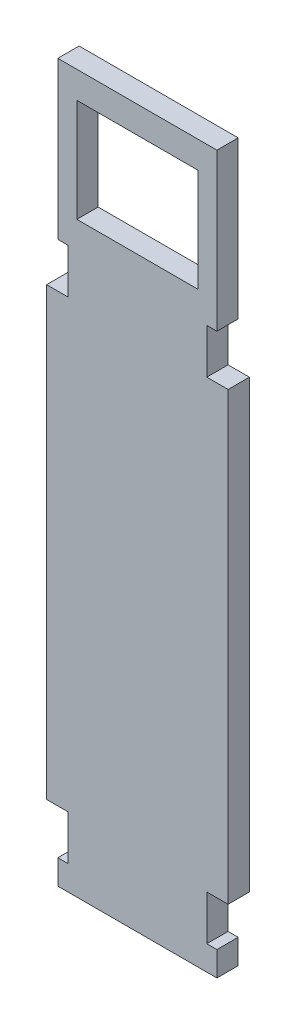
ISO-10303-21;
HEADER;
FILE_DESCRIPTION(('STEP AP214'),'2;1');
FILE_NAME('part.step','',(''),(''),'','','');
FILE_SCHEMA(('AUTOMOTIVE_DESIGN { 1 0 10303 214 1 1 1 1 }'));
ENDSEC;
DATA;
#1=APPLICATION_CONTEXT('core data for automotive mechanical design processes');
#2=APPLICATION_PROTOCOL_DEFINITION('international standard','automotive_design',2000,#1);
#3=PRODUCT_CONTEXT('',#1,'mechanical');
#4=PRODUCT('Part','Part','',(#3));
#5=PRODUCT_RELATED_PRODUCT_CATEGORY('part','',(#4));
#6=PRODUCT_DEFINITION_FORMATION('','',#4);
#7=PRODUCT_DEFINITION_CONTEXT('part definition',#1,'design');
#8=PRODUCT_DEFINITION('design','',#6,#7);
#9=PRODUCT_DEFINITION_SHAPE('','',#8);
#10=(LENGTH_UNIT() NAMED_UNIT(*) SI_UNIT(.MILLI.,.METRE.));
#11=(NAMED_UNIT(*) PLANE_ANGLE_UNIT() SI_UNIT($,.RADIAN.));
#12=(NAMED_UNIT(*) SI_UNIT($,.STERADIAN.) SOLID_ANGLE_UNIT());
#13=UNCERTAINTY_MEASURE_WITH_UNIT(LENGTH_MEASURE(1.E-05),#10,'distance_accuracy_value','');
#14=(GEOMETRIC_REPRESENTATION_CONTEXT(3) GLOBAL_UNCERTAINTY_ASSIGNED_CONTEXT((#13)) GLOBAL_UNIT_ASSIGNED_CONTEXT((#10,
#11,#12)) REPRESENTATION_CONTEXT('',''));
#15=CARTESIAN_POINT('',(0.,0.,0.));
#16=DIRECTION('',(0.,0.,1.));
#17=DIRECTION('',(1.,0.,0.));
#18=AXIS2_PLACEMENT_3D('',#15,#16,#17);
#19=CARTESIAN_POINT('',(0.,0.,4.75));
#20=DIRECTION('',(0.,0.,1.));
#21=DIRECTION('',(1.,0.,0.));
#22=AXIS2_PLACEMENT_3D('',#19,#20,#21);
#23=PLANE('',#22);
#24=DIRECTION('',(0.,1.,0.));
#25=VECTOR('',#24,1.);
#26=CARTESIAN_POINT('',(33.25,119.5,4.75));
#27=LINE('',#26,#25);
#28=CARTESIAN_POINT('',(33.25,119.5,4.75));
#29=VERTEX_POINT('',#28);
#30=CARTESIAN_POINT('',(33.25,154.5,4.75));
#31=VERTEX_POINT('',#30);
#32=EDGE_CURVE('E230',#29,#31,#27,.T.);
#33=ORIENTED_EDGE('',*,*,#32,.T.);
#34=DIRECTION('',(-1.,0.,0.));
#35=VECTOR('',#34,1.);
#36=CARTESIAN_POINT('',(33.25,154.5,4.75));
#37=LINE('',#36,#35);
#38=CARTESIAN_POINT('',(-2.25000000000001,154.5,4.75));
#39=VERTEX_POINT('',#38);
#40=EDGE_CURVE('E233',#31,#39,#37,.T.);
#41=ORIENTED_EDGE('',*,*,#40,.T.);
#42=DIRECTION('',(0.,-1.,0.));
#43=VECTOR('',#42,1.);
#44=CARTESIAN_POINT('',(-2.24999999999997,119.5,4.75));
#45=LINE('',#44,#43);
#46=CARTESIAN_POINT('',(-2.24999999999997,119.5,4.75));
#47=VERTEX_POINT('',#46);
#48=EDGE_CURVE('E236',#39,#47,#45,.T.);
#49=ORIENTED_EDGE('',*,*,#48,.T.);
#50=DIRECTION('',(1.,0.,0.));
#51=VECTOR('',#50,1.);
#52=CARTESIAN_POINT('',(0.,119.5,4.75));
#53=LINE('',#52,#51);
#54=CARTESIAN_POINT('',(0.,119.5,4.75));
#55=VERTEX_POINT('',#54);
#56=EDGE_CURVE('E238',#47,#55,#53,.T.);
#57=ORIENTED_EDGE('',*,*,#56,.T.);
#58=DIRECTION('',(0.,-1.,0.));
#59=VECTOR('',#58,1.);
#60=CARTESIAN_POINT('',(0.,119.5,4.75));
#61=LINE('',#60,#59);
#62=CARTESIAN_POINT('',(0.,109.5,4.75));
#63=VERTEX_POINT('',#62);
#64=EDGE_CURVE('E240',#55,#63,#61,.T.);
#65=ORIENTED_EDGE('',*,*,#64,.T.);
#66=DIRECTION('',(-1.,0.,0.));
#67=VECTOR('',#66,1.);
#68=CARTESIAN_POINT('',(-4.75,109.5,4.75));
#69=LINE('',#68,#67);
#70=CARTESIAN_POINT('',(-4.75,109.5,4.75));
#71=VERTEX_POINT('',#70);
#72=EDGE_CURVE('E242',#63,#71,#69,.T.);
#73=ORIENTED_EDGE('',*,*,#72,.T.);
#74=DIRECTION('',(0.,-1.,0.));
#75=VECTOR('',#74,1.);
#76=CARTESIAN_POINT('',(-4.75,9.99999999999999,4.75));
#77=LINE('',#76,#75);
#78=CARTESIAN_POINT('',(-4.75,9.99999999999999,4.75));
#79=VERTEX_POINT('',#78);
#80=EDGE_CURVE('E244',#71,#79,#77,.T.);
#81=ORIENTED_EDGE('',*,*,#80,.T.);
#82=DIRECTION('',(1.,0.,0.));
#83=VECTOR('',#82,1.);
#84=CARTESIAN_POINT('',(-4.75,9.99999999999999,4.75));
#85=LINE('',#84,#83);
#86=CARTESIAN_POINT('',(0.,9.99999999999999,4.75));
#87=VERTEX_POINT('',#86);
#88=EDGE_CURVE('E246',#79,#87,#85,.T.);
#89=ORIENTED_EDGE('',*,*,#88,.T.);
#90=DIRECTION('',(0.,-1.,0.));
#91=VECTOR('',#90,1.);
#92=CARTESIAN_POINT('',(0.,0.,4.75));
#93=LINE('',#92,#91);
#94=CARTESIAN_POINT('',(0.,0.,4.75));
#95=VERTEX_POINT('',#94);
#96=EDGE_CURVE('E248',#87,#95,#93,.T.);
#97=ORIENTED_EDGE('',*,*,#96,.T.);
#98=DIRECTION('',(-1.,0.,0.));
#99=VECTOR('',#98,1.);
#100=CARTESIAN_POINT('',(0.,0.,4.75));
#101=LINE('',#100,#99);
#102=CARTESIAN_POINT('',(-2.24999999999999,0.,4.75));
#103=VERTEX_POINT('',#102);
#104=EDGE_CURVE('E250',#95,#103,#101,.T.);
#105=ORIENTED_EDGE('',*,*,#104,.T.);
#106=DIRECTION('',(0.,-1.,0.));
#107=VECTOR('',#106,1.);
#108=CARTESIAN_POINT('',(-2.24999999999999,0.,4.75));
#109=LINE('',#108,#107);
#110=CARTESIAN_POINT('',(-2.24999999999999,-5.49999999999998,4.75));
#111=VERTEX_POINT('',#110);
#112=EDGE_CURVE('E252',#103,#111,#109,.T.);
#113=ORIENTED_EDGE('',*,*,#112,.T.);
#114=DIRECTION('',(1.,0.,0.));
#115=VECTOR('',#114,1.);
#116=CARTESIAN_POINT('',(33.25,-5.49999999999998,4.75));
#117=LINE('',#116,#115);
#118=CARTESIAN_POINT('',(33.25,-5.49999999999998,4.75));
#119=VERTEX_POINT('',#118);
#120=EDGE_CURVE('E254',#111,#119,#117,.T.);
#121=ORIENTED_EDGE('',*,*,#120,.T.);
#122=DIRECTION('',(0.,1.,0.));
#123=VECTOR('',#122,1.);
#124=CARTESIAN_POINT('',(33.25,0.,4.75));
#125=LINE('',#124,#123);
#126=CARTESIAN_POINT('',(33.25,0.,4.75));
#127=VERTEX_POINT('',#126);
#128=EDGE_CURVE('E256',#119,#127,#125,.T.);
#129=ORIENTED_EDGE('',*,*,#128,.T.);
#130=DIRECTION('',(-1.,0.,0.));
#131=VECTOR('',#130,1.);
#132=CARTESIAN_POINT('',(33.25,0.,4.75));
#133=LINE('',#132,#131);
#134=CARTESIAN_POINT('',(31.,0.,4.75));
#135=VERTEX_POINT('',#134);
#136=EDGE_CURVE('E258',#127,#135,#133,.T.);
#137=ORIENTED_EDGE('',*,*,#136,.T.);
#138=DIRECTION('',(0.,1.,0.));
#139=VECTOR('',#138,1.);
#140=CARTESIAN_POINT('',(31.,0.,4.75));
#141=LINE('',#140,#139);
#142=CARTESIAN_POINT('',(31.,9.99999999999999,4.75));
#143=VERTEX_POINT('',#142);
#144=EDGE_CURVE('E260',#135,#143,#141,.T.);
#145=ORIENTED_EDGE('',*,*,#144,.T.);
#146=DIRECTION('',(1.,0.,0.));
#147=VECTOR('',#146,1.);
#148=CARTESIAN_POINT('',(35.75,9.99999999999999,4.75));
#149=LINE('',#148,#147);
#150=CARTESIAN_POINT('',(35.75,9.99999999999999,4.75));
#151=VERTEX_POINT('',#150);
#152=EDGE_CURVE('E262',#143,#151,#149,.T.);
#153=ORIENTED_EDGE('',*,*,#152,.T.);
#154=DIRECTION('',(0.,1.,0.));
#155=VECTOR('',#154,1.);
#156=CARTESIAN_POINT('',(35.75,9.99999999999999,4.75));
#157=LINE('',#156,#155);
#158=CARTESIAN_POINT('',(35.75,109.5,4.75));
#159=VERTEX_POINT('',#158);
#160=EDGE_CURVE('E264',#151,#159,#157,.T.);
#161=ORIENTED_EDGE('',*,*,#160,.T.);
#162=DIRECTION('',(-1.,0.,0.));
#163=VECTOR('',#162,1.);
#164=CARTESIAN_POINT('',(35.75,109.5,4.75));
#165=LINE('',#164,#163);
#166=CARTESIAN_POINT('',(31.,109.5,4.75));
#167=VERTEX_POINT('',#166);
#168=EDGE_CURVE('E266',#159,#167,#165,.T.);
#169=ORIENTED_EDGE('',*,*,#168,.T.);
#170=DIRECTION('',(0.,1.,0.));
#171=VECTOR('',#170,1.);
#172=CARTESIAN_POINT('',(31.,119.5,4.75));
#173=LINE('',#172,#171);
#174=CARTESIAN_POINT('',(31.,119.5,4.75));
#175=VERTEX_POINT('',#174);
#176=EDGE_CURVE('E268',#167,#175,#173,.T.);
#177=ORIENTED_EDGE('',*,*,#176,.T.);
#178=DIRECTION('',(1.,0.,0.));
#179=VECTOR('',#178,1.);
#180=CARTESIAN_POINT('',(33.25,119.5,4.75));
#181=LINE('',#180,#179);
#182=EDGE_CURVE('E270',#175,#29,#181,.T.);
#183=ORIENTED_EDGE('',*,*,#182,.T.);
#184=EDGE_LOOP('',(#33,#41,#49,#57,#65,#73,#81,#89,#97,#105,#113,#121,#129,#137,#145,#153,#161,
#169,#177,#183));
#185=FACE_BOUND('',#184,.T.);
#186=DIRECTION('',(-1.,0.,0.));
#187=VECTOR('',#186,1.);
#188=CARTESIAN_POINT('',(2.,148.5,4.75));
#189=LINE('',#188,#187);
#190=CARTESIAN_POINT('',(29.,148.5,4.75));
#191=VERTEX_POINT('',#190);
#192=CARTESIAN_POINT('',(2.,148.5,4.75));
#193=VERTEX_POINT('',#192);
#194=EDGE_CURVE('E202',#191,#193,#189,.T.);
#195=ORIENTED_EDGE('',*,*,#194,.F.);
#196=DIRECTION('',(0.,1.,0.));
#197=VECTOR('',#196,1.);
#198=CARTESIAN_POINT('',(29.,125.5,4.75));
#199=LINE('',#198,#197);
#200=CARTESIAN_POINT('',(29.,125.5,4.75));
#201=VERTEX_POINT('',#200);
#202=EDGE_CURVE('E194',#201,#191,#199,.T.);
#203=ORIENTED_EDGE('',*,*,#202,.F.);
#204=DIRECTION('',(1.,0.,0.));
#205=VECTOR('',#204,1.);
#206=CARTESIAN_POINT('',(2.,125.5,4.75));
#207=LINE('',#206,#205);
#208=CARTESIAN_POINT('',(2.,125.5,4.75));
#209=VERTEX_POINT('',#208);
#210=EDGE_CURVE('E216',#209,#201,#207,.T.);
#211=ORIENTED_EDGE('',*,*,#210,.F.);
#212=DIRECTION('',(0.,-1.,0.));
#213=VECTOR('',#212,1.);
#214=CARTESIAN_POINT('',(2.,125.5,4.75));
#215=LINE('',#214,#213);
#216=EDGE_CURVE('E214',#193,#209,#215,.T.);
#217=ORIENTED_EDGE('',*,*,#216,.F.);
#218=EDGE_LOOP('',(#195,#203,#211,#217));
#219=FACE_BOUND('',#218,.T.);
#220=ADVANCED_FACE('F33',(#185,#219),#23,.T.);
#221=CARTESIAN_POINT('',(0.,0.,0.));
#222=DIRECTION('',(0.,0.,1.));
#223=DIRECTION('',(1.,0.,0.));
#224=AXIS2_PLACEMENT_3D('',#221,#222,#223);
#225=PLANE('',#224);
#226=DIRECTION('',(0.,1.,0.));
#227=VECTOR('',#226,1.);
#228=CARTESIAN_POINT('',(33.25,119.5,0.));
#229=LINE('',#228,#227);
#230=CARTESIAN_POINT('',(33.25,119.5,0.));
#231=VERTEX_POINT('',#230);
#232=CARTESIAN_POINT('',(33.25,154.5,0.));
#233=VERTEX_POINT('',#232);
#234=EDGE_CURVE('E210',#231,#233,#229,.T.);
#235=ORIENTED_EDGE('',*,*,#234,.F.);
#236=DIRECTION('',(1.,0.,0.));
#237=VECTOR('',#236,1.);
#238=CARTESIAN_POINT('',(33.25,119.5,0.));
#239=LINE('',#238,#237);
#240=CARTESIAN_POINT('',(31.,119.5,0.));
#241=VERTEX_POINT('',#240);
#242=EDGE_CURVE('E234',#241,#231,#239,.T.);
#243=ORIENTED_EDGE('',*,*,#242,.F.);
#244=DIRECTION('',(0.,1.,0.));
#245=VECTOR('',#244,1.);
#246=CARTESIAN_POINT('',(31.,119.5,0.));
#247=LINE('',#246,#245);
#248=CARTESIAN_POINT('',(31.,109.5,0.));
#249=VERTEX_POINT('',#248);
#250=EDGE_CURVE('E309',#249,#241,#247,.T.);
#251=ORIENTED_EDGE('',*,*,#250,.F.);
#252=DIRECTION('',(-1.,0.,0.));
#253=VECTOR('',#252,1.);
#254=CARTESIAN_POINT('',(35.75,109.5,0.));
#255=LINE('',#254,#253);
#256=CARTESIAN_POINT('',(35.75,109.5,0.));
#257=VERTEX_POINT('',#256);
#258=EDGE_CURVE('E307',#257,#249,#255,.T.);
#259=ORIENTED_EDGE('',*,*,#258,.F.);
#260=DIRECTION('',(0.,1.,0.));
#261=VECTOR('',#260,1.);
#262=CARTESIAN_POINT('',(35.75,9.99999999999999,0.));
#263=LINE('',#262,#261);
#264=CARTESIAN_POINT('',(35.75,9.99999999999999,0.));
#265=VERTEX_POINT('',#264);
#266=EDGE_CURVE('E305',#265,#257,#263,.T.);
#267=ORIENTED_EDGE('',*,*,#266,.F.);
#268=DIRECTION('',(1.,0.,0.));
#269=VECTOR('',#268,1.);
#270=CARTESIAN_POINT('',(35.75,9.99999999999999,0.));
#271=LINE('',#270,#269);
#272=CARTESIAN_POINT('',(31.,9.99999999999999,0.));
#273=VERTEX_POINT('',#272);
#274=EDGE_CURVE('E303',#273,#265,#271,.T.);
#275=ORIENTED_EDGE('',*,*,#274,.F.);
#276=DIRECTION('',(0.,1.,0.));
#277=VECTOR('',#276,1.);
#278=CARTESIAN_POINT('',(31.,0.,0.));
#279=LINE('',#278,#277);
#280=CARTESIAN_POINT('',(31.,0.,0.));
#281=VERTEX_POINT('',#280);
#282=EDGE_CURVE('E301',#281,#273,#279,.T.);
#283=ORIENTED_EDGE('',*,*,#282,.F.);
#284=DIRECTION('',(-1.,0.,0.));
#285=VECTOR('',#284,1.);
#286=CARTESIAN_POINT('',(33.25,0.,0.));
#287=LINE('',#286,#285);
#288=CARTESIAN_POINT('',(33.25,0.,0.));
#289=VERTEX_POINT('',#288);
#290=EDGE_CURVE('E299',#289,#281,#287,.T.);
#291=ORIENTED_EDGE('',*,*,#290,.F.);
#292=DIRECTION('',(0.,1.,0.));
#293=VECTOR('',#292,1.);
#294=CARTESIAN_POINT('',(33.25,0.,0.));
#295=LINE('',#294,#293);
#296=CARTESIAN_POINT('',(33.25,-5.49999999999998,0.));
#297=VERTEX_POINT('',#296);
#298=EDGE_CURVE('E297',#297,#289,#295,.T.);
#299=ORIENTED_EDGE('',*,*,#298,.F.);
#300=DIRECTION('',(1.,0.,0.));
#301=VECTOR('',#300,1.);
#302=CARTESIAN_POINT('',(33.25,-5.49999999999998,0.));
#303=LINE('',#302,#301);
#304=CARTESIAN_POINT('',(-2.24999999999999,-5.49999999999998,0.));
#305=VERTEX_POINT('',#304);
#306=EDGE_CURVE('E295',#305,#297,#303,.T.);
#307=ORIENTED_EDGE('',*,*,#306,.F.);
#308=DIRECTION('',(0.,-1.,0.));
#309=VECTOR('',#308,1.);
#310=CARTESIAN_POINT('',(-2.24999999999999,0.,0.));
#311=LINE('',#310,#309);
#312=CARTESIAN_POINT('',(-2.24999999999999,0.,0.));
#313=VERTEX_POINT('',#312);
#314=EDGE_CURVE('E293',#313,#305,#311,.T.);
#315=ORIENTED_EDGE('',*,*,#314,.F.);
#316=DIRECTION('',(-1.,0.,0.));
#317=VECTOR('',#316,1.);
#318=CARTESIAN_POINT('',(0.,0.,0.));
#319=LINE('',#318,#317);
#320=CARTESIAN_POINT('',(0.,0.,0.));
#321=VERTEX_POINT('',#320);
#322=EDGE_CURVE('E291',#321,#313,#319,.T.);
#323=ORIENTED_EDGE('',*,*,#322,.F.);
#324=DIRECTION('',(0.,-1.,0.));
#325=VECTOR('',#324,1.);
#326=CARTESIAN_POINT('',(0.,0.,0.));
#327=LINE('',#326,#325);
#328=CARTESIAN_POINT('',(0.,9.99999999999999,0.));
#329=VERTEX_POINT('',#328);
#330=EDGE_CURVE('E289',#329,#321,#327,.T.);
#331=ORIENTED_EDGE('',*,*,#330,.F.);
#332=DIRECTION('',(1.,0.,0.));
#333=VECTOR('',#332,1.);
#334=CARTESIAN_POINT('',(-4.75,9.99999999999999,0.));
#335=LINE('',#334,#333);
#336=CARTESIAN_POINT('',(-4.75,9.99999999999999,0.));
#337=VERTEX_POINT('',#336);
#338=EDGE_CURVE('E287',#337,#329,#335,.T.);
#339=ORIENTED_EDGE('',*,*,#338,.F.);
#340=DIRECTION('',(0.,-1.,0.));
#341=VECTOR('',#340,1.);
#342=CARTESIAN_POINT('',(-4.75,9.99999999999999,0.));
#343=LINE('',#342,#341);
#344=CARTESIAN_POINT('',(-4.75,109.5,0.));
#345=VERTEX_POINT('',#344);
#346=EDGE_CURVE('E285',#345,#337,#343,.T.);
#347=ORIENTED_EDGE('',*,*,#346,.F.);
#348=DIRECTION('',(-1.,0.,0.));
#349=VECTOR('',#348,1.);
#350=CARTESIAN_POINT('',(-4.75,109.5,0.));
#351=LINE('',#350,#349);
#352=CARTESIAN_POINT('',(0.,109.5,0.));
#353=VERTEX_POINT('',#352);
#354=EDGE_CURVE('E283',#353,#345,#351,.T.);
#355=ORIENTED_EDGE('',*,*,#354,.F.);
#356=DIRECTION('',(0.,-1.,0.));
#357=VECTOR('',#356,1.);
#358=CARTESIAN_POINT('',(0.,119.5,0.));
#359=LINE('',#358,#357);
#360=CARTESIAN_POINT('',(0.,119.5,0.));
#361=VERTEX_POINT('',#360);
#362=EDGE_CURVE('E281',#361,#353,#359,.T.);
#363=ORIENTED_EDGE('',*,*,#362,.F.);
#364=DIRECTION('',(1.,0.,0.));
#365=VECTOR('',#364,1.);
#366=CARTESIAN_POINT('',(0.,119.5,0.));
#367=LINE('',#366,#365);
#368=CARTESIAN_POINT('',(-2.24999999999997,119.5,0.));
#369=VERTEX_POINT('',#368);
#370=EDGE_CURVE('E279',#369,#361,#367,.T.);
#371=ORIENTED_EDGE('',*,*,#370,.F.);
#372=DIRECTION('',(0.,-1.,0.));
#373=VECTOR('',#372,1.);
#374=CARTESIAN_POINT('',(-2.24999999999997,119.5,0.));
#375=LINE('',#374,#373);
#376=CARTESIAN_POINT('',(-2.25000000000001,154.5,0.));
#377=VERTEX_POINT('',#376);
#378=EDGE_CURVE('E277',#377,#369,#375,.T.);
#379=ORIENTED_EDGE('',*,*,#378,.F.);
#380=DIRECTION('',(-1.,0.,0.));
#381=VECTOR('',#380,1.);
#382=CARTESIAN_POINT('',(33.25,154.5,0.));
#383=LINE('',#382,#381);
#384=EDGE_CURVE('E275',#233,#377,#383,.T.);
#385=ORIENTED_EDGE('',*,*,#384,.F.);
#386=EDGE_LOOP('',(#235,#243,#251,#259,#267,#275,#283,#291,#299,#307,#315,#323,#331,#339,#347,
#355,#363,#371,#379,#385));
#387=FACE_BOUND('',#386,.T.);
#388=DIRECTION('',(0.,1.,0.));
#389=VECTOR('',#388,1.);
#390=CARTESIAN_POINT('',(29.,125.5,0.));
#391=LINE('',#390,#389);
#392=CARTESIAN_POINT('',(29.,125.5,0.));
#393=VERTEX_POINT('',#392);
#394=CARTESIAN_POINT('',(29.,148.5,0.));
#395=VERTEX_POINT('',#394);
#396=EDGE_CURVE('E56',#393,#395,#391,.T.);
#397=ORIENTED_EDGE('',*,*,#396,.T.);
#398=DIRECTION('',(-1.,0.,0.));
#399=VECTOR('',#398,1.);
#400=CARTESIAN_POINT('',(2.,148.5,0.));
#401=LINE('',#400,#399);
#402=CARTESIAN_POINT('',(2.,148.5,0.));
#403=VERTEX_POINT('',#402);
#404=EDGE_CURVE('E209',#395,#403,#401,.T.);
#405=ORIENTED_EDGE('',*,*,#404,.T.);
#406=DIRECTION('',(0.,-1.,0.));
#407=VECTOR('',#406,1.);
#408=CARTESIAN_POINT('',(2.,125.5,0.));
#409=LINE('',#408,#407);
#410=CARTESIAN_POINT('',(2.,125.5,0.));
#411=VERTEX_POINT('',#410);
#412=EDGE_CURVE('E222',#403,#411,#409,.T.);
#413=ORIENTED_EDGE('',*,*,#412,.T.);
#414=DIRECTION('',(1.,0.,0.));
#415=VECTOR('',#414,1.);
#416=CARTESIAN_POINT('',(2.,125.5,0.));
#417=LINE('',#416,#415);
#418=EDGE_CURVE('E203',#411,#393,#417,.T.);
#419=ORIENTED_EDGE('',*,*,#418,.T.);
#420=EDGE_LOOP('',(#397,#405,#413,#419));
#421=FACE_BOUND('',#420,.T.);
#422=ADVANCED_FACE('F375',(#387,#421),#225,.F.);
#423=CARTESIAN_POINT('',(33.25,119.5,4.75));
#424=DIRECTION('',(-1.,0.,0.));
#425=DIRECTION('',(0.,-1.,0.));
#426=AXIS2_PLACEMENT_3D('',#423,#424,#425);
#427=PLANE('',#426);
#428=ORIENTED_EDGE('',*,*,#234,.T.);
#429=DIRECTION('',(0.,0.,-1.));
#430=VECTOR('',#429,1.);
#431=CARTESIAN_POINT('',(33.25,154.5,4.75));
#432=LINE('',#431,#430);
#433=EDGE_CURVE('E11',#31,#233,#432,.T.);
#434=ORIENTED_EDGE('',*,*,#433,.F.);
#435=ORIENTED_EDGE('',*,*,#32,.F.);
#436=DIRECTION('',(0.,0.,-1.));
#437=VECTOR('',#436,1.);
#438=CARTESIAN_POINT('',(33.25,119.5,4.75));
#439=LINE('',#438,#437);
#440=EDGE_CURVE('E272',#29,#231,#439,.T.);
#441=ORIENTED_EDGE('',*,*,#440,.T.);
#442=EDGE_LOOP('',(#428,#434,#435,#441));
#443=FACE_BOUND('',#442,.T.);
#444=ADVANCED_FACE('F35',(#443),#427,.F.);
#445=CARTESIAN_POINT('',(33.25,154.5,4.75));
#446=DIRECTION('',(0.,-1.,0.));
#447=DIRECTION('',(0.,0.,-1.));
#448=AXIS2_PLACEMENT_3D('',#445,#446,#447);
#449=PLANE('',#448);
#450=ORIENTED_EDGE('',*,*,#384,.T.);
#451=DIRECTION('',(0.,0.,-1.));
#452=VECTOR('',#451,1.);
#453=CARTESIAN_POINT('',(-2.25000000000001,154.5,4.75));
#454=LINE('',#453,#452);
#455=EDGE_CURVE('E41',#39,#377,#454,.T.);
#456=ORIENTED_EDGE('',*,*,#455,.F.);
#457=ORIENTED_EDGE('',*,*,#40,.F.);
#458=ORIENTED_EDGE('',*,*,#433,.T.);
#459=EDGE_LOOP('',(#450,#456,#457,#458));
#460=FACE_BOUND('',#459,.T.);
#461=ADVANCED_FACE('F392',(#460),#449,.F.);
#462=CARTESIAN_POINT('',(-2.24999999999997,119.5,4.75));
#463=DIRECTION('',(1.,0.,0.));
#464=DIRECTION('',(0.,1.,0.));
#465=AXIS2_PLACEMENT_3D('',#462,#463,#464);
#466=PLANE('',#465);
#467=ORIENTED_EDGE('',*,*,#378,.T.);
#468=DIRECTION('',(0.,0.,-1.));
#469=VECTOR('',#468,1.);
#470=CARTESIAN_POINT('',(-2.24999999999997,119.5,4.75));
#471=LINE('',#470,#469);
#472=EDGE_CURVE('E362',#47,#369,#471,.T.);
#473=ORIENTED_EDGE('',*,*,#472,.F.);
#474=ORIENTED_EDGE('',*,*,#48,.F.);
#475=ORIENTED_EDGE('',*,*,#455,.T.);
#476=EDGE_LOOP('',(#467,#473,#474,#475));
#477=FACE_BOUND('',#476,.T.);
#478=ADVANCED_FACE('F369',(#477),#466,.F.);
#479=CARTESIAN_POINT('',(0.,119.5,4.75));
#480=DIRECTION('',(0.,1.,0.));
#481=DIRECTION('',(0.,0.,1.));
#482=AXIS2_PLACEMENT_3D('',#479,#480,#481);
#483=PLANE('',#482);
#484=ORIENTED_EDGE('',*,*,#370,.T.);
#485=DIRECTION('',(0.,0.,-1.));
#486=VECTOR('',#485,1.);
#487=CARTESIAN_POINT('',(0.,119.5,4.75));
#488=LINE('',#487,#486);
#489=EDGE_CURVE('E359',#55,#361,#488,.T.);
#490=ORIENTED_EDGE('',*,*,#489,.F.);
#491=ORIENTED_EDGE('',*,*,#56,.F.);
#492=ORIENTED_EDGE('',*,*,#472,.T.);
#493=EDGE_LOOP('',(#484,#490,#491,#492));
#494=FACE_BOUND('',#493,.T.);
#495=ADVANCED_FACE('F381',(#494),#483,.F.);
#496=CARTESIAN_POINT('',(0.,119.5,4.75));
#497=DIRECTION('',(1.,0.,0.));
#498=DIRECTION('',(0.,1.,0.));
#499=AXIS2_PLACEMENT_3D('',#496,#497,#498);
#500=PLANE('',#499);
#501=ORIENTED_EDGE('',*,*,#362,.T.);
#502=DIRECTION('',(0.,0.,-1.));
#503=VECTOR('',#502,1.);
#504=CARTESIAN_POINT('',(0.,109.5,4.75));
#505=LINE('',#504,#503);
#506=EDGE_CURVE('E356',#63,#353,#505,.T.);
#507=ORIENTED_EDGE('',*,*,#506,.F.);
#508=ORIENTED_EDGE('',*,*,#64,.F.);
#509=ORIENTED_EDGE('',*,*,#489,.T.);
#510=EDGE_LOOP('',(#501,#507,#508,#509));
#511=FACE_BOUND('',#510,.T.);
#512=ADVANCED_FACE('F385',(#511),#500,.F.);
#513=CARTESIAN_POINT('',(-4.75,109.5,4.75));
#514=DIRECTION('',(0.,-1.,0.));
#515=DIRECTION('',(0.,0.,-1.));
#516=AXIS2_PLACEMENT_3D('',#513,#514,#515);
#517=PLANE('',#516);
#518=ORIENTED_EDGE('',*,*,#354,.T.);
#519=DIRECTION('',(0.,0.,-1.));
#520=VECTOR('',#519,1.);
#521=CARTESIAN_POINT('',(-4.75,109.5,4.75));
#522=LINE('',#521,#520);
#523=EDGE_CURVE('E353',#71,#345,#522,.T.);
#524=ORIENTED_EDGE('',*,*,#523,.F.);
#525=ORIENTED_EDGE('',*,*,#72,.F.);
#526=ORIENTED_EDGE('',*,*,#506,.T.);
#527=EDGE_LOOP('',(#518,#524,#525,#526));
#528=FACE_BOUND('',#527,.T.);
#529=ADVANCED_FACE('F465',(#528),#517,.F.);
#530=CARTESIAN_POINT('',(-4.75,9.99999999999999,4.75));
#531=DIRECTION('',(1.,0.,0.));
#532=DIRECTION('',(0.,1.,0.));
#533=AXIS2_PLACEMENT_3D('',#530,#531,#532);
#534=PLANE('',#533);
#535=ORIENTED_EDGE('',*,*,#346,.T.);
#536=DIRECTION('',(0.,0.,-1.));
#537=VECTOR('',#536,1.);
#538=CARTESIAN_POINT('',(-4.75,9.99999999999999,4.75));
#539=LINE('',#538,#537);
#540=EDGE_CURVE('E350',#79,#337,#539,.T.);
#541=ORIENTED_EDGE('',*,*,#540,.F.);
#542=ORIENTED_EDGE('',*,*,#80,.F.);
#543=ORIENTED_EDGE('',*,*,#523,.T.);
#544=EDGE_LOOP('',(#535,#541,#542,#543));
#545=FACE_BOUND('',#544,.T.);
#546=ADVANCED_FACE('F463',(#545),#534,.F.);
#547=CARTESIAN_POINT('',(-4.75,9.99999999999999,4.75));
#548=DIRECTION('',(0.,1.,0.));
#549=DIRECTION('',(-1.,0.,0.));
#550=AXIS2_PLACEMENT_3D('',#547,#548,#549);
#551=PLANE('',#550);
#552=ORIENTED_EDGE('',*,*,#338,.T.);
#553=DIRECTION('',(0.,0.,-1.));
#554=VECTOR('',#553,1.);
#555=CARTESIAN_POINT('',(0.,9.99999999999999,4.75));
#556=LINE('',#555,#554);
#557=EDGE_CURVE('E347',#87,#329,#556,.T.);
#558=ORIENTED_EDGE('',*,*,#557,.F.);
#559=ORIENTED_EDGE('',*,*,#88,.F.);
#560=ORIENTED_EDGE('',*,*,#540,.T.);
#561=EDGE_LOOP('',(#552,#558,#559,#560));
#562=FACE_BOUND('',#561,.T.);
#563=ADVANCED_FACE('F458',(#562),#551,.F.);
#564=CARTESIAN_POINT('',(0.,0.,4.75));
#565=DIRECTION('',(1.,0.,0.));
#566=DIRECTION('',(0.,0.,-1.));
#567=AXIS2_PLACEMENT_3D('',#564,#565,#566);
#568=PLANE('',#567);
#569=ORIENTED_EDGE('',*,*,#330,.T.);
#570=DIRECTION('',(0.,0.,-1.));
#571=VECTOR('',#570,1.);
#572=CARTESIAN_POINT('',(0.,0.,4.75));
#573=LINE('',#572,#571);
#574=EDGE_CURVE('E344',#95,#321,#573,.T.);
#575=ORIENTED_EDGE('',*,*,#574,.F.);
#576=ORIENTED_EDGE('',*,*,#96,.F.);
#577=ORIENTED_EDGE('',*,*,#557,.T.);
#578=EDGE_LOOP('',(#569,#575,#576,#577));
#579=FACE_BOUND('',#578,.T.);
#580=ADVANCED_FACE('F453',(#579),#568,.F.);
#581=CARTESIAN_POINT('',(0.,0.,4.75));
#582=DIRECTION('',(0.,-1.,0.));
#583=DIRECTION('',(1.,0.,0.));
#584=AXIS2_PLACEMENT_3D('',#581,#582,#583);
#585=PLANE('',#584);
#586=ORIENTED_EDGE('',*,*,#322,.T.);
#587=DIRECTION('',(0.,0.,-1.));
#588=VECTOR('',#587,1.);
#589=CARTESIAN_POINT('',(-2.24999999999999,0.,4.75));
#590=LINE('',#589,#588);
#591=EDGE_CURVE('E341',#103,#313,#590,.T.);
#592=ORIENTED_EDGE('',*,*,#591,.F.);
#593=ORIENTED_EDGE('',*,*,#104,.F.);
#594=ORIENTED_EDGE('',*,*,#574,.T.);
#595=EDGE_LOOP('',(#586,#592,#593,#594));
#596=FACE_BOUND('',#595,.T.);
#597=ADVANCED_FACE('F449',(#596),#585,.F.);
#598=CARTESIAN_POINT('',(-2.24999999999999,0.,4.75));
#599=DIRECTION('',(1.,0.,0.));
#600=DIRECTION('',(0.,1.,0.));
#601=AXIS2_PLACEMENT_3D('',#598,#599,#600);
#602=PLANE('',#601);
#603=ORIENTED_EDGE('',*,*,#314,.T.);
#604=DIRECTION('',(0.,0.,-1.));
#605=VECTOR('',#604,1.);
#606=CARTESIAN_POINT('',(-2.24999999999999,-5.49999999999998,4.75));
#607=LINE('',#606,#605);
#608=EDGE_CURVE('E338',#111,#305,#607,.T.);
#609=ORIENTED_EDGE('',*,*,#608,.F.);
#610=ORIENTED_EDGE('',*,*,#112,.F.);
#611=ORIENTED_EDGE('',*,*,#591,.T.);
#612=EDGE_LOOP('',(#603,#609,#610,#611));
#613=FACE_BOUND('',#612,.T.);
#614=ADVANCED_FACE('F444',(#613),#602,.F.);
#615=CARTESIAN_POINT('',(33.25,-5.49999999999998,4.75));
#616=DIRECTION('',(0.,1.,0.));
#617=DIRECTION('',(0.,0.,1.));
#618=AXIS2_PLACEMENT_3D('',#615,#616,#617);
#619=PLANE('',#618);
#620=ORIENTED_EDGE('',*,*,#306,.T.);
#621=DIRECTION('',(0.,0.,-1.));
#622=VECTOR('',#621,1.);
#623=CARTESIAN_POINT('',(33.25,-5.49999999999998,4.75));
#624=LINE('',#623,#622);
#625=EDGE_CURVE('E335',#119,#297,#624,.T.);
#626=ORIENTED_EDGE('',*,*,#625,.F.);
#627=ORIENTED_EDGE('',*,*,#120,.F.);
#628=ORIENTED_EDGE('',*,*,#608,.T.);
#629=EDGE_LOOP('',(#620,#626,#627,#628));
#630=FACE_BOUND('',#629,.T.);
#631=ADVANCED_FACE('F438',(#630),#619,.F.);
#632=CARTESIAN_POINT('',(33.25,0.,4.75));
#633=DIRECTION('',(-1.,0.,0.));
#634=DIRECTION('',(0.,0.,1.));
#635=AXIS2_PLACEMENT_3D('',#632,#633,#634);
#636=PLANE('',#635);
#637=ORIENTED_EDGE('',*,*,#298,.T.);
#638=DIRECTION('',(0.,0.,-1.));
#639=VECTOR('',#638,1.);
#640=CARTESIAN_POINT('',(33.25,0.,4.75));
#641=LINE('',#640,#639);
#642=EDGE_CURVE('E332',#127,#289,#641,.T.);
#643=ORIENTED_EDGE('',*,*,#642,.F.);
#644=ORIENTED_EDGE('',*,*,#128,.F.);
#645=ORIENTED_EDGE('',*,*,#625,.T.);
#646=EDGE_LOOP('',(#637,#643,#644,#645));
#647=FACE_BOUND('',#646,.T.);
#648=ADVANCED_FACE('F434',(#647),#636,.F.);
#649=CARTESIAN_POINT('',(33.25,0.,4.75));
#650=DIRECTION('',(0.,-1.,0.));
#651=DIRECTION('',(1.,0.,0.));
#652=AXIS2_PLACEMENT_3D('',#649,#650,#651);
#653=PLANE('',#652);
#654=ORIENTED_EDGE('',*,*,#290,.T.);
#655=DIRECTION('',(0.,0.,-1.));
#656=VECTOR('',#655,1.);
#657=CARTESIAN_POINT('',(31.,0.,4.75));
#658=LINE('',#657,#656);
#659=EDGE_CURVE('E329',#135,#281,#658,.T.);
#660=ORIENTED_EDGE('',*,*,#659,.F.);
#661=ORIENTED_EDGE('',*,*,#136,.F.);
#662=ORIENTED_EDGE('',*,*,#642,.T.);
#663=EDGE_LOOP('',(#654,#660,#661,#662));
#664=FACE_BOUND('',#663,.T.);
#665=ADVANCED_FACE('F429',(#664),#653,.F.);
#666=CARTESIAN_POINT('',(31.,0.,4.75));
#667=DIRECTION('',(-1.,0.,0.));
#668=DIRECTION('',(0.,0.,1.));
#669=AXIS2_PLACEMENT_3D('',#666,#667,#668);
#670=PLANE('',#669);
#671=ORIENTED_EDGE('',*,*,#282,.T.);
#672=DIRECTION('',(0.,0.,-1.));
#673=VECTOR('',#672,1.);
#674=CARTESIAN_POINT('',(31.,9.99999999999999,4.75));
#675=LINE('',#674,#673);
#676=EDGE_CURVE('E326',#143,#273,#675,.T.);
#677=ORIENTED_EDGE('',*,*,#676,.F.);
#678=ORIENTED_EDGE('',*,*,#144,.F.);
#679=ORIENTED_EDGE('',*,*,#659,.T.);
#680=EDGE_LOOP('',(#671,#677,#678,#679));
#681=FACE_BOUND('',#680,.T.);
#682=ADVANCED_FACE('F423',(#681),#670,.F.);
#683=CARTESIAN_POINT('',(35.75,9.99999999999999,4.75));
#684=DIRECTION('',(0.,1.,0.));
#685=DIRECTION('',(0.,0.,1.));
#686=AXIS2_PLACEMENT_3D('',#683,#684,#685);
#687=PLANE('',#686);
#688=ORIENTED_EDGE('',*,*,#274,.T.);
#689=DIRECTION('',(0.,0.,-1.));
#690=VECTOR('',#689,1.);
#691=CARTESIAN_POINT('',(35.75,9.99999999999999,4.75));
#692=LINE('',#691,#690);
#693=EDGE_CURVE('E323',#151,#265,#692,.T.);
#694=ORIENTED_EDGE('',*,*,#693,.F.);
#695=ORIENTED_EDGE('',*,*,#152,.F.);
#696=ORIENTED_EDGE('',*,*,#676,.T.);
#697=EDGE_LOOP('',(#688,#694,#695,#696));
#698=FACE_BOUND('',#697,.T.);
#699=ADVANCED_FACE('F419',(#698),#687,.F.);
#700=CARTESIAN_POINT('',(35.75,9.99999999999999,4.75));
#701=DIRECTION('',(-1.,0.,0.));
#702=DIRECTION('',(0.,-1.,0.));
#703=AXIS2_PLACEMENT_3D('',#700,#701,#702);
#704=PLANE('',#703);
#705=ORIENTED_EDGE('',*,*,#266,.T.);
#706=DIRECTION('',(0.,0.,-1.));
#707=VECTOR('',#706,1.);
#708=CARTESIAN_POINT('',(35.75,109.5,4.75));
#709=LINE('',#708,#707);
#710=EDGE_CURVE('E320',#159,#257,#709,.T.);
#711=ORIENTED_EDGE('',*,*,#710,.F.);
#712=ORIENTED_EDGE('',*,*,#160,.F.);
#713=ORIENTED_EDGE('',*,*,#693,.T.);
#714=EDGE_LOOP('',(#705,#711,#712,#713));
#715=FACE_BOUND('',#714,.T.);
#716=ADVANCED_FACE('F414',(#715),#704,.F.);
#717=CARTESIAN_POINT('',(35.75,109.5,4.75));
#718=DIRECTION('',(0.,-1.,0.));
#719=DIRECTION('',(1.,0.,0.));
#720=AXIS2_PLACEMENT_3D('',#717,#718,#719);
#721=PLANE('',#720);
#722=ORIENTED_EDGE('',*,*,#258,.T.);
#723=DIRECTION('',(0.,0.,-1.));
#724=VECTOR('',#723,1.);
#725=CARTESIAN_POINT('',(31.,109.5,4.75));
#726=LINE('',#725,#724);
#727=EDGE_CURVE('E317',#167,#249,#726,.T.);
#728=ORIENTED_EDGE('',*,*,#727,.F.);
#729=ORIENTED_EDGE('',*,*,#168,.F.);
#730=ORIENTED_EDGE('',*,*,#710,.T.);
#731=EDGE_LOOP('',(#722,#728,#729,#730));
#732=FACE_BOUND('',#731,.T.);
#733=ADVANCED_FACE('F408',(#732),#721,.F.);
#734=CARTESIAN_POINT('',(31.,119.5,4.75));
#735=DIRECTION('',(-1.,0.,0.));
#736=DIRECTION('',(0.,-1.,0.));
#737=AXIS2_PLACEMENT_3D('',#734,#735,#736);
#738=PLANE('',#737);
#739=ORIENTED_EDGE('',*,*,#250,.T.);
#740=DIRECTION('',(0.,0.,-1.));
#741=VECTOR('',#740,1.);
#742=CARTESIAN_POINT('',(31.,119.5,4.75));
#743=LINE('',#742,#741);
#744=EDGE_CURVE('E314',#175,#241,#743,.T.);
#745=ORIENTED_EDGE('',*,*,#744,.F.);
#746=ORIENTED_EDGE('',*,*,#176,.F.);
#747=ORIENTED_EDGE('',*,*,#727,.T.);
#748=EDGE_LOOP('',(#739,#745,#746,#747));
#749=FACE_BOUND('',#748,.T.);
#750=ADVANCED_FACE('F404',(#749),#738,.F.);
#751=CARTESIAN_POINT('',(33.25,119.5,4.75));
#752=DIRECTION('',(0.,1.,0.));
#753=DIRECTION('',(-1.,0.,0.));
#754=AXIS2_PLACEMENT_3D('',#751,#752,#753);
#755=PLANE('',#754);
#756=ORIENTED_EDGE('',*,*,#242,.T.);
#757=ORIENTED_EDGE('',*,*,#440,.F.);
#758=ORIENTED_EDGE('',*,*,#182,.F.);
#759=ORIENTED_EDGE('',*,*,#744,.T.);
#760=EDGE_LOOP('',(#756,#757,#758,#759));
#761=FACE_BOUND('',#760,.T.);
#762=ADVANCED_FACE('F399',(#761),#755,.F.);
#763=CARTESIAN_POINT('',(29.,125.5,4.75));
#764=DIRECTION('',(-1.,0.,0.));
#765=DIRECTION('',(0.,0.,1.));
#766=AXIS2_PLACEMENT_3D('',#763,#764,#765);
#767=PLANE('',#766);
#768=ORIENTED_EDGE('',*,*,#396,.F.);
#769=DIRECTION('',(0.,0.,-1.));
#770=VECTOR('',#769,1.);
#771=CARTESIAN_POINT('',(29.,125.5,4.75));
#772=LINE('',#771,#770);
#773=EDGE_CURVE('E198',#201,#393,#772,.T.);
#774=ORIENTED_EDGE('',*,*,#773,.F.);
#775=ORIENTED_EDGE('',*,*,#202,.T.);
#776=DIRECTION('',(0.,0.,-1.));
#777=VECTOR('',#776,1.);
#778=CARTESIAN_POINT('',(29.,148.5,4.75));
#779=LINE('',#778,#777);
#780=EDGE_CURVE('E197',#191,#395,#779,.T.);
#781=ORIENTED_EDGE('',*,*,#780,.T.);
#782=EDGE_LOOP('',(#768,#774,#775,#781));
#783=FACE_BOUND('',#782,.T.);
#784=ADVANCED_FACE('F196',(#783),#767,.T.);
#785=CARTESIAN_POINT('',(2.,148.5,4.75));
#786=DIRECTION('',(0.,-1.,0.));
#787=DIRECTION('',(0.,0.,-1.));
#788=AXIS2_PLACEMENT_3D('',#785,#786,#787);
#789=PLANE('',#788);
#790=ORIENTED_EDGE('',*,*,#404,.F.);
#791=ORIENTED_EDGE('',*,*,#780,.F.);
#792=ORIENTED_EDGE('',*,*,#194,.T.);
#793=DIRECTION('',(0.,0.,-1.));
#794=VECTOR('',#793,1.);
#795=CARTESIAN_POINT('',(2.,148.5,4.75));
#796=LINE('',#795,#794);
#797=EDGE_CURVE('E211',#193,#403,#796,.T.);
#798=ORIENTED_EDGE('',*,*,#797,.T.);
#799=EDGE_LOOP('',(#790,#791,#792,#798));
#800=FACE_BOUND('',#799,.T.);
#801=ADVANCED_FACE('F206',(#800),#789,.T.);
#802=CARTESIAN_POINT('',(2.,125.5,4.75));
#803=DIRECTION('',(1.,0.,0.));
#804=DIRECTION('',(0.,0.,-1.));
#805=AXIS2_PLACEMENT_3D('',#802,#803,#804);
#806=PLANE('',#805);
#807=ORIENTED_EDGE('',*,*,#412,.F.);
#808=ORIENTED_EDGE('',*,*,#797,.F.);
#809=ORIENTED_EDGE('',*,*,#216,.T.);
#810=DIRECTION('',(0.,0.,-1.));
#811=VECTOR('',#810,1.);
#812=CARTESIAN_POINT('',(2.,125.5,4.75));
#813=LINE('',#812,#811);
#814=EDGE_CURVE('E48',#209,#411,#813,.T.);
#815=ORIENTED_EDGE('',*,*,#814,.T.);
#816=EDGE_LOOP('',(#807,#808,#809,#815));
#817=FACE_BOUND('',#816,.T.);
#818=ADVANCED_FACE('F571',(#817),#806,.T.);
#819=CARTESIAN_POINT('',(2.,125.5,4.75));
#820=DIRECTION('',(0.,1.,0.));
#821=DIRECTION('',(0.,0.,1.));
#822=AXIS2_PLACEMENT_3D('',#819,#820,#821);
#823=PLANE('',#822);
#824=ORIENTED_EDGE('',*,*,#418,.F.);
#825=ORIENTED_EDGE('',*,*,#814,.F.);
#826=ORIENTED_EDGE('',*,*,#210,.T.);
#827=ORIENTED_EDGE('',*,*,#773,.T.);
#828=EDGE_LOOP('',(#824,#825,#826,#827));
#829=FACE_BOUND('',#828,.T.);
#830=ADVANCED_FACE('F577',(#829),#823,.T.);
#831=CLOSED_SHELL('',(#220,#422,#444,#461,#478,#495,#512,#529,#546,#563,#580,#597,#614,#631,
#648,#665,#682,#699,#716,#733,#750,#762,#784,#801,#818,#830));
#832=MANIFOLD_SOLID_BREP('B2',#831);
#833=ADVANCED_BREP_SHAPE_REPRESENTATION('',(#18,#832),#14);
#834=SHAPE_DEFINITION_REPRESENTATION(#9,#833);
ENDSEC;
END-ISO-10303-21;
